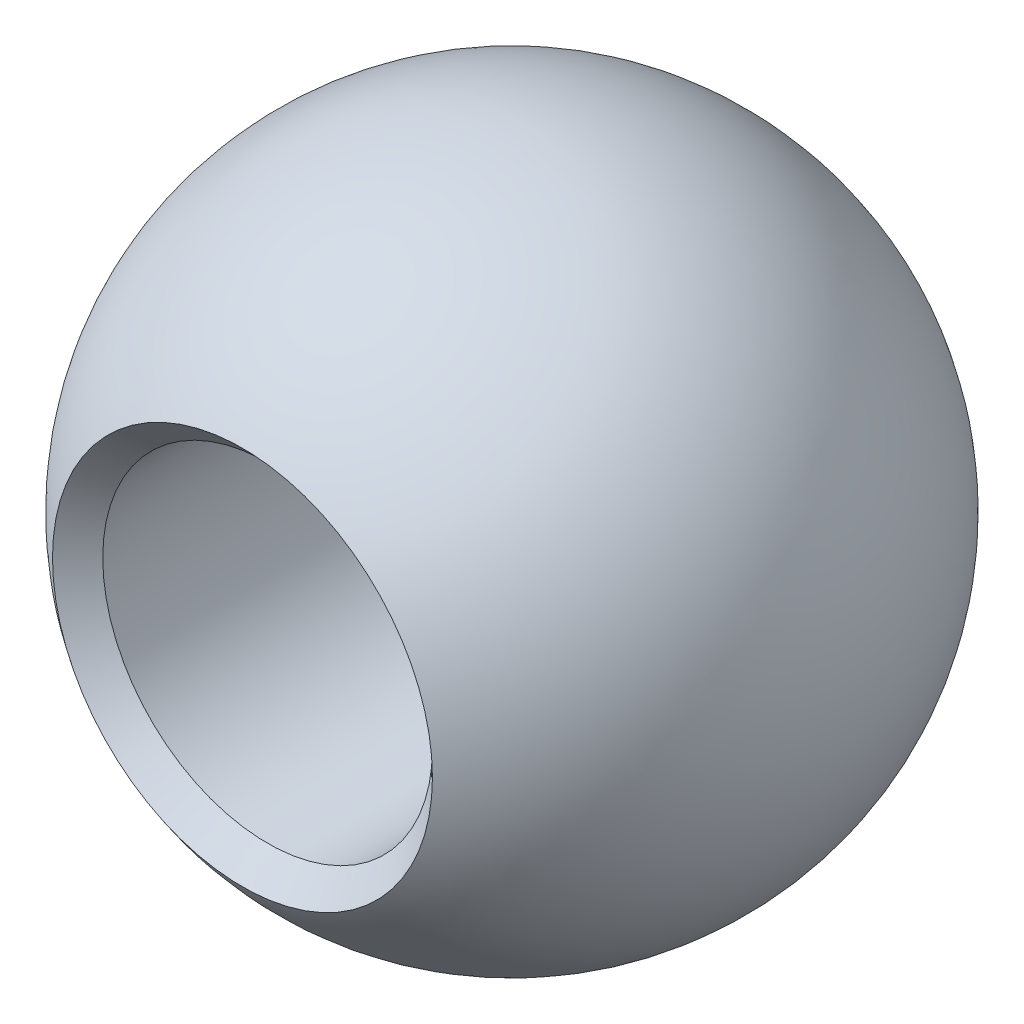
ISO-10303-21;
HEADER;
FILE_DESCRIPTION(('STEP AP214'),'2;1');
FILE_NAME('part.step','',(''),(''),'','','');
FILE_SCHEMA(('AUTOMOTIVE_DESIGN { 1 0 10303 214 1 1 1 1 }'));
ENDSEC;
DATA;
#1=APPLICATION_CONTEXT('core data for automotive mechanical design processes');
#2=APPLICATION_PROTOCOL_DEFINITION('international standard','automotive_design',2000,#1);
#3=PRODUCT_CONTEXT('',#1,'mechanical');
#4=PRODUCT('Part','Part','',(#3));
#5=PRODUCT_RELATED_PRODUCT_CATEGORY('part','',(#4));
#6=PRODUCT_DEFINITION_FORMATION('','',#4);
#7=PRODUCT_DEFINITION_CONTEXT('part definition',#1,'design');
#8=PRODUCT_DEFINITION('design','',#6,#7);
#9=PRODUCT_DEFINITION_SHAPE('','',#8);
#10=(LENGTH_UNIT() NAMED_UNIT(*) SI_UNIT(.MILLI.,.METRE.));
#11=(NAMED_UNIT(*) PLANE_ANGLE_UNIT() SI_UNIT($,.RADIAN.));
#12=(NAMED_UNIT(*) SI_UNIT($,.STERADIAN.) SOLID_ANGLE_UNIT());
#13=UNCERTAINTY_MEASURE_WITH_UNIT(LENGTH_MEASURE(1.E-05),#10,'distance_accuracy_value','');
#14=(GEOMETRIC_REPRESENTATION_CONTEXT(3) GLOBAL_UNCERTAINTY_ASSIGNED_CONTEXT((#13)) GLOBAL_UNIT_ASSIGNED_CONTEXT((#10,
#11,#12)) REPRESENTATION_CONTEXT('',''));
#15=CARTESIAN_POINT('',(0.,0.,0.));
#16=DIRECTION('',(0.,0.,1.));
#17=DIRECTION('',(1.,0.,0.));
#18=AXIS2_PLACEMENT_3D('',#15,#16,#17);
#19=CARTESIAN_POINT('',(0.,0.,0.));
#20=DIRECTION('',(0.,1.,0.));
#21=DIRECTION('',(1.,0.,0.));
#22=AXIS2_PLACEMENT_3D('',#19,#20,#21);
#23=SPHERICAL_SURFACE('',#22,8.);
#24=CARTESIAN_POINT('',(0.,0.,0.));
#25=DIRECTION('',(0.,0.,1.));
#26=DIRECTION('',(1.,0.,0.));
#27=AXIS2_PLACEMENT_3D('',#24,#25,#26);
#28=SPHERICAL_SURFACE('',#27,8.);
#29=CARTESIAN_POINT('',(0.,0.,-6.53819419381716));
#30=DIRECTION('',(0.,0.,1.));
#31=DIRECTION('',(1.,0.,0.));
#32=AXIS2_PLACEMENT_3D('',#29,#30,#31);
#33=CIRCLE('',#32,4.60999096354164);
#34=CARTESIAN_POINT('',(4.60999096354164,0.,-6.53819419381716));
#35=VERTEX_POINT('',#34);
#36=EDGE_CURVE('E43',#35,#35,#33,.T.);
#37=ORIENTED_EDGE('',*,*,#36,.T.);
#38=EDGE_LOOP('',(#37));
#39=FACE_BOUND('',#38,.T.);
#40=CARTESIAN_POINT('',(0.,0.,6.53819419381716));
#41=DIRECTION('',(0.,0.,-1.));
#42=DIRECTION('',(-1.,0.,0.));
#43=AXIS2_PLACEMENT_3D('',#40,#41,#42);
#44=CIRCLE('',#43,4.60999096354165);
#45=CARTESIAN_POINT('',(-4.60999096354165,0.,6.53819419381716));
#46=VERTEX_POINT('',#45);
#47=EDGE_CURVE('E47',#46,#46,#44,.T.);
#48=ORIENTED_EDGE('',*,*,#47,.T.);
#49=EDGE_LOOP('',(#48));
#50=FACE_BOUND('',#49,.T.);
#51=ADVANCED_FACE('F32',(#39,#50),#28,.T.);
#52=CARTESIAN_POINT('',(0.,0.,-8.));
#53=DIRECTION('',(0.,0.,1.));
#54=DIRECTION('',(1.,0.,0.));
#55=AXIS2_PLACEMENT_3D('',#52,#53,#54);
#56=CYLINDRICAL_SURFACE('',#55,4.);
#57=CARTESIAN_POINT('',(0.,0.,-5.92820323027552));
#58=DIRECTION('',(0.,0.,1.));
#59=DIRECTION('',(1.,0.,0.));
#60=AXIS2_PLACEMENT_3D('',#57,#58,#59);
#61=CIRCLE('',#60,4.);
#62=CARTESIAN_POINT('',(4.,0.,-5.92820323027552));
#63=VERTEX_POINT('',#62);
#64=EDGE_CURVE('E10',#63,#63,#61,.F.);
#65=ORIENTED_EDGE('',*,*,#64,.T.);
#66=EDGE_LOOP('',(#65));
#67=FACE_BOUND('',#66,.T.);
#68=CARTESIAN_POINT('',(0.,0.,5.92820323027551));
#69=DIRECTION('',(0.,0.,-1.));
#70=DIRECTION('',(-1.,0.,0.));
#71=AXIS2_PLACEMENT_3D('',#68,#69,#70);
#72=CIRCLE('',#71,4.);
#73=CARTESIAN_POINT('',(-4.,0.,5.92820323027551));
#74=VERTEX_POINT('',#73);
#75=EDGE_CURVE('E39',#74,#74,#72,.F.);
#76=ORIENTED_EDGE('',*,*,#75,.T.);
#77=EDGE_LOOP('',(#76));
#78=FACE_BOUND('',#77,.T.);
#79=ADVANCED_FACE('F60',(#67,#78),#56,.F.);
#80=CARTESIAN_POINT('',(0.,0.,-6.53819419381716));
#81=DIRECTION('',(0.,0.,-1.));
#82=DIRECTION('',(-1.,0.,0.));
#83=AXIS2_PLACEMENT_3D('',#80,#81,#82);
#84=CONICAL_SURFACE('',#83,4.60999096354164,0.785398163397443);
#85=ORIENTED_EDGE('',*,*,#64,.F.);
#86=EDGE_LOOP('',(#85));
#87=FACE_BOUND('',#86,.T.);
#88=ORIENTED_EDGE('',*,*,#36,.F.);
#89=EDGE_LOOP('',(#88));
#90=FACE_BOUND('',#89,.T.);
#91=ADVANCED_FACE('F55',(#87,#90),#84,.F.);
#92=CARTESIAN_POINT('',(0.,0.,6.53819419381715));
#93=DIRECTION('',(0.,0.,1.));
#94=DIRECTION('',(1.,0.,0.));
#95=AXIS2_PLACEMENT_3D('',#92,#93,#94);
#96=CONICAL_SURFACE('',#95,4.60999096354165,0.785398163397448);
#97=ORIENTED_EDGE('',*,*,#75,.F.);
#98=EDGE_LOOP('',(#97));
#99=FACE_BOUND('',#98,.T.);
#100=ORIENTED_EDGE('',*,*,#47,.F.);
#101=EDGE_LOOP('',(#100));
#102=FACE_BOUND('',#101,.T.);
#103=ADVANCED_FACE('F34',(#99,#102),#96,.F.);
#104=CLOSED_SHELL('',(#51,#79,#91,#103));
#105=MANIFOLD_SOLID_BREP('B2',#104);
#106=ADVANCED_BREP_SHAPE_REPRESENTATION('',(#18,#105),#14);
#107=SHAPE_DEFINITION_REPRESENTATION(#9,#106);
ENDSEC;
END-ISO-10303-21;
